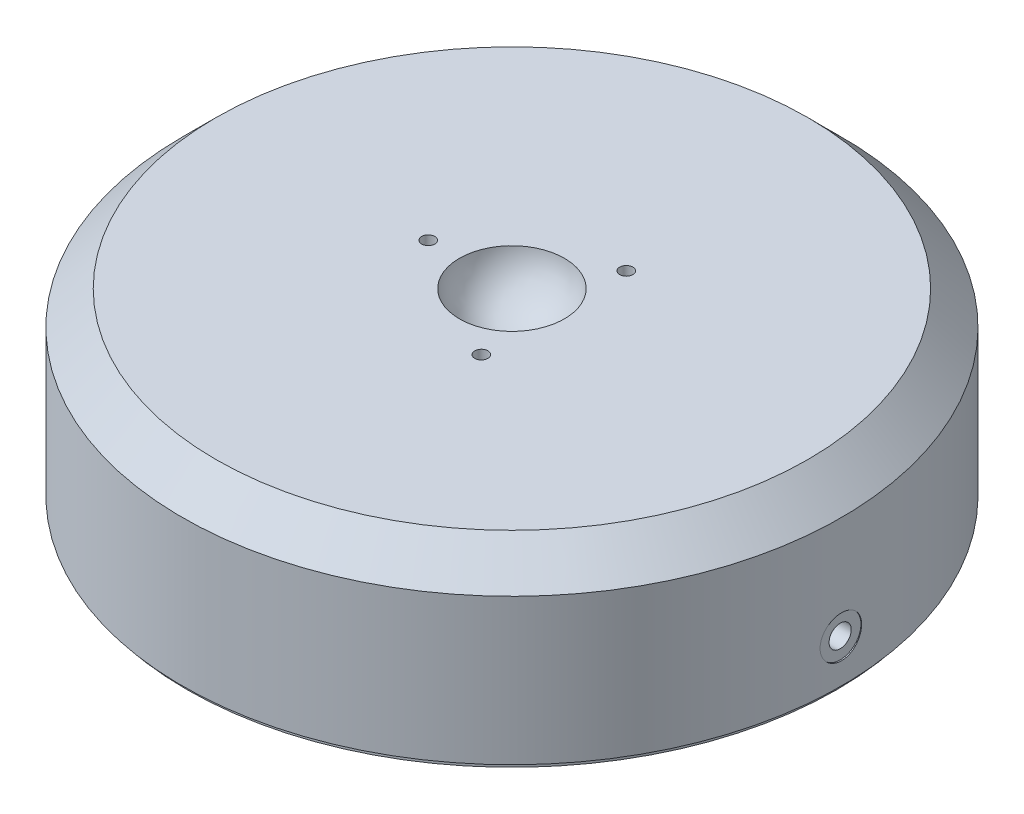
ISO-10303-21;
HEADER;
FILE_DESCRIPTION(('STEP AP214'),'2;1');
FILE_NAME('part.step','',(''),(''),'','','');
FILE_SCHEMA(('AUTOMOTIVE_DESIGN { 1 0 10303 214 1 1 1 1 }'));
ENDSEC;
DATA;
#1=APPLICATION_CONTEXT('core data for automotive mechanical design processes');
#2=APPLICATION_PROTOCOL_DEFINITION('international standard','automotive_design',2000,#1);
#3=PRODUCT_CONTEXT('',#1,'mechanical');
#4=PRODUCT('Part','Part','',(#3));
#5=PRODUCT_RELATED_PRODUCT_CATEGORY('part','',(#4));
#6=PRODUCT_DEFINITION_FORMATION('','',#4);
#7=PRODUCT_DEFINITION_CONTEXT('part definition',#1,'design');
#8=PRODUCT_DEFINITION('design','',#6,#7);
#9=PRODUCT_DEFINITION_SHAPE('','',#8);
#10=(LENGTH_UNIT() NAMED_UNIT(*) SI_UNIT(.MILLI.,.METRE.));
#11=(NAMED_UNIT(*) PLANE_ANGLE_UNIT() SI_UNIT($,.RADIAN.));
#12=(NAMED_UNIT(*) SI_UNIT($,.STERADIAN.) SOLID_ANGLE_UNIT());
#13=UNCERTAINTY_MEASURE_WITH_UNIT(LENGTH_MEASURE(1.E-05),#10,'distance_accuracy_value','');
#14=(GEOMETRIC_REPRESENTATION_CONTEXT(3) GLOBAL_UNCERTAINTY_ASSIGNED_CONTEXT((#13)) GLOBAL_UNIT_ASSIGNED_CONTEXT((#10,
#11,#12)) REPRESENTATION_CONTEXT('',''));
#15=CARTESIAN_POINT('',(0.,0.,0.));
#16=DIRECTION('',(0.,0.,1.));
#17=DIRECTION('',(1.,0.,0.));
#18=AXIS2_PLACEMENT_3D('',#15,#16,#17);
#19=CARTESIAN_POINT('',(0.,0.,0.));
#20=DIRECTION('',(0.,1.,0.));
#21=DIRECTION('',(-1.,0.,0.));
#22=AXIS2_PLACEMENT_3D('',#19,#20,#21);
#23=PLANE('',#22);
#24=CARTESIAN_POINT('',(0.,0.,0.));
#25=DIRECTION('',(0.,1.,0.));
#26=DIRECTION('',(-1.,0.,0.));
#27=AXIS2_PLACEMENT_3D('',#24,#25,#26);
#28=CIRCLE('',#27,62.4967);
#29=CARTESIAN_POINT('',(-62.4967,0.,0.));
#30=VERTEX_POINT('',#29);
#31=EDGE_CURVE('E107',#30,#30,#28,.T.);
#32=ORIENTED_EDGE('',*,*,#31,.F.);
#33=EDGE_LOOP('',(#32));
#34=FACE_BOUND('',#33,.T.);
#35=CARTESIAN_POINT('',(0.,0.,0.));
#36=DIRECTION('',(0.,1.,0.));
#37=DIRECTION('',(-1.,0.,0.));
#38=AXIS2_PLACEMENT_3D('',#35,#36,#37);
#39=CIRCLE('',#38,61.6585);
#40=CARTESIAN_POINT('',(-61.6585,0.,0.));
#41=VERTEX_POINT('',#40);
#42=EDGE_CURVE('E11',#41,#41,#39,.F.);
#43=ORIENTED_EDGE('',*,*,#42,.F.);
#44=EDGE_LOOP('',(#43));
#45=FACE_BOUND('',#44,.T.);
#46=ADVANCED_FACE('F36',(#34,#45),#23,.F.);
#47=CARTESIAN_POINT('',(0.,23.9776,0.));
#48=DIRECTION('',(0.,1.,0.));
#49=DIRECTION('',(-1.,0.,0.));
#50=AXIS2_PLACEMENT_3D('',#47,#48,#49);
#51=CYLINDRICAL_SURFACE('',#50,62.4967);
#52=CARTESIAN_POINT('',(62.372570428755,8.0772,-3.937));
#53=CARTESIAN_POINT('',(62.3725720890185,7.85629250819205,-3.93699028096386));
#54=CARTESIAN_POINT('',(62.373756645424,7.63523042415557,-3.91834463505911));
#55=CARTESIAN_POINT('',(62.3783674224861,7.19921058508358,-3.84423125504575));
#56=CARTESIAN_POINT('',(62.3817962508653,6.98426023509272,-3.78872068479168));
#57=CARTESIAN_POINT('',(62.3905056547258,6.56684276609008,-3.64247846283324));
#58=CARTESIAN_POINT('',(62.3957852511349,6.36436911325499,-3.55176543082544));
#59=CARTESIAN_POINT('',(62.4076000641261,5.97757517470127,-3.33772347926589));
#60=CARTESIAN_POINT('',(62.4141349934931,5.79325075107633,-3.21440201796466));
#61=CARTESIAN_POINT('',(62.4277354120478,5.44765365078752,-2.93843774005859));
#62=CARTESIAN_POINT('',(62.4348016030348,5.28641231300762,-2.78575570829224));
#63=CARTESIAN_POINT('',(62.4486618186523,4.99182664468489,-2.45548530935192));
#64=CARTESIAN_POINT('',(62.4554558319102,4.85848347884577,-2.27789590285199));
#65=CARTESIAN_POINT('',(62.468012201994,4.62338340749682,-1.90267557457054));
#66=CARTESIAN_POINT('',(62.4737737129147,4.52165235142673,-1.70502842569229));
#67=CARTESIAN_POINT('',(62.4836085077519,4.35282980074007,-1.29541689605991));
#68=CARTESIAN_POINT('',(62.487681809973,4.28573793054393,-1.0834526705686));
#69=CARTESIAN_POINT('',(62.49367638382,4.18818497861431,-0.651525065695927));
#70=CARTESIAN_POINT('',(62.4956005319607,4.15767493025864,-0.431572786215224));
#71=CARTESIAN_POINT('',(62.4970896768904,4.13400047292234,0.0103389858161218));
#72=CARTESIAN_POINT('',(62.496654700625,4.14083563738937,0.232298455411981));
#73=CARTESIAN_POINT('',(62.4934770102329,4.1916171894393,0.671592310122174));
#74=CARTESIAN_POINT('',(62.4907375716901,4.23551090198289,0.888932811350949));
#75=CARTESIAN_POINT('',(62.4832631387856,4.35908182429764,1.31315483091667));
#76=CARTESIAN_POINT('',(62.4785281324773,4.43875924829095,1.52003628663143));
#77=CARTESIAN_POINT('',(62.4675900480543,4.63169546939245,1.91763665629313));
#78=CARTESIAN_POINT('',(62.4613859272532,4.74497813191741,2.10834395966332));
#79=CARTESIAN_POINT('',(62.4482078169555,5.00189178554977,2.46805574331988));
#80=CARTESIAN_POINT('',(62.4412338186534,5.14552312378974,2.63705997532779));
#81=CARTESIAN_POINT('',(62.4272865012383,5.45935444740958,2.94887566314058));
#82=CARTESIAN_POINT('',(62.4203132043516,5.6296001541432,3.09164110706965));
#83=CARTESIAN_POINT('',(62.4071655711437,5.99166739260435,3.34657185626651));
#84=CARTESIAN_POINT('',(62.4009912351459,6.1834889330644,3.45873714914927));
#85=CARTESIAN_POINT('',(62.3901387793076,6.58329203302694,3.64928038608318));
#86=CARTESIAN_POINT('',(62.3854607457017,6.79127452305716,3.72765638288402));
#87=CARTESIAN_POINT('',(62.3781315105066,7.21748220730516,3.84836440374867));
#88=CARTESIAN_POINT('',(62.3754802846928,7.43570727906942,3.89069685860943));
#89=CARTESIAN_POINT('',(62.3725081902671,7.87580413283266,3.93805878781967));
#90=CARTESIAN_POINT('',(62.3721833258386,8.09766900552034,3.94315222515225));
#91=CARTESIAN_POINT('',(62.3738901507959,8.53910035206581,3.91605866417158));
#92=CARTESIAN_POINT('',(62.3759218277217,8.75866683806987,3.88387186297355));
#93=CARTESIAN_POINT('',(62.3821091297166,9.18908778425891,3.78318462756799));
#94=CARTESIAN_POINT('',(62.3862630312323,9.39994916428616,3.71471365967655));
#95=CARTESIAN_POINT('',(62.3962252084388,9.80718791277105,3.54343158124978));
#96=CARTESIAN_POINT('',(62.4020334993717,10.0035651477642,3.4406201543318));
#97=CARTESIAN_POINT('',(62.4146596060516,10.3765549593453,3.20341218055619));
#98=CARTESIAN_POINT('',(62.4214787868046,10.553140235677,3.06897278003505));
#99=CARTESIAN_POINT('',(62.4353534416259,10.8812584879436,2.77238746211599));
#100=CARTESIAN_POINT('',(62.442408918043,11.032791214756,2.61024126923443));
#101=CARTESIAN_POINT('',(62.4559728000091,11.30671900463,2.26256979509692));
#102=CARTESIAN_POINT('',(62.4624804199821,11.4290726729886,2.07701186445178));
#103=CARTESIAN_POINT('',(62.4742040159706,11.6408858924198,1.68794839143629));
#104=CARTESIAN_POINT('',(62.4794200000555,11.7303456489985,1.48444296120355));
#105=CARTESIAN_POINT('',(62.4879688513937,11.8737596296695,1.06541336581375));
#106=CARTESIAN_POINT('',(62.4913031072478,11.9277400402159,0.849898192498591));
#107=CARTESIAN_POINT('',(62.4957183439937,11.998748719611,0.412841808212963));
#108=CARTESIAN_POINT('',(62.4967993474728,12.0157773588748,0.19130065767116));
#109=CARTESIAN_POINT('',(62.4965863440578,12.0123955028836,-0.251109233314158));
#110=CARTESIAN_POINT('',(62.4952964464352,11.9920497853074,-0.47197847382767));
#111=CARTESIAN_POINT('',(62.4904948505731,11.9146310775853,-0.907158003403282));
#112=CARTESIAN_POINT('',(62.4869831484417,11.8575580231069,-1.12146828097584));
#113=CARTESIAN_POINT('',(62.4781326434797,11.7083193821693,-1.53745606376745));
#114=CARTESIAN_POINT('',(62.4727938550518,11.6161540723376,-1.73913366855358));
#115=CARTESIAN_POINT('',(62.4608885568106,11.3993561443507,-2.12416059858145));
#116=CARTESIAN_POINT('',(62.4543220785873,11.2747243615664,-2.30751039523456));
#117=CARTESIAN_POINT('',(62.440686478893,10.9962919324557,-2.65100563744978));
#118=CARTESIAN_POINT('',(62.433616561856,10.8424444482703,-2.81111308409266));
#119=CARTESIAN_POINT('',(62.4197772500197,10.5100108368205,-3.10328437062465));
#120=CARTESIAN_POINT('',(62.4130079291752,10.3314186657346,-3.23534133924044));
#121=CARTESIAN_POINT('',(62.4005267642416,9.95435823532383,-3.46776249632599));
#122=CARTESIAN_POINT('',(62.3948162566916,9.75586533550635,-3.56808673979917));
#123=CARTESIAN_POINT('',(62.3851164023794,9.3449607681873,-3.73386158971641));
#124=CARTESIAN_POINT('',(62.3811250415325,9.13256572595419,-3.79935302616075));
#125=CARTESIAN_POINT('',(62.3763610444554,8.77859348472015,-3.87658833170758));
#126=CARTESIAN_POINT('',(62.3749459193762,8.63930414883599,-3.89921339547466));
#127=CARTESIAN_POINT('',(62.3730500824086,8.35909752799471,-3.9294223202492));
#128=CARTESIAN_POINT('',(62.3725693691967,8.21818024534366,-3.93700620256057));
#129=CARTESIAN_POINT('',(62.372570428755,8.0772,-3.937));
#130=B_SPLINE_CURVE_WITH_KNOTS('',3,(#52,#53,#54,#55,#56,#57,#58,#59,#60,#61,#62,#63,#64,#65,
#66,#67,#68,#69,#70,#71,#72,#73,#74,#75,#76,#77,#78,#79,#80,#81,#82,#83,#84,#85,#86,#87,#88,#89,
#90,#91,#92,#93,#94,#95,#96,#97,#98,#99,#100,#101,#102,#103,#104,#105,#106,#107,#108,#109,#110,
#111,#112,#113,#114,#115,#116,#117,#118,#119,#120,#121,#122,#123,#124,#125,#126,#127,#128,#129),
.UNSPECIFIED.,.T.,.F.,(4,2,2,2,2,2,2,2,2,2,2,2,2,2,2,2,2,2,2,2,2,2,2,2,2,2,2,2,2,2,2,2,2,2,2,2,
2,2,4),(0.,0.662207807942045,1.32518643473369,1.98781486805592,2.65029187487592,
3.31365993681306,3.97705568777383,4.64099248314746,5.30492207955468,5.96796197686456,
6.63099430103149,7.29308577428267,7.95518121125223,8.61774797849119,9.28032232467586,
9.94404768890895,10.6077733217764,11.271537199514,11.935293143751,12.5979087301274,
13.2605208130116,13.9225956124307,14.5846765117903,15.2476597035839,15.9106494876833,
16.5745742967136,17.2384949577749,17.9019250430013,18.5653484777832,19.227623143937,
19.889898970152,20.5521695758428,21.2144231428203,21.8777475204073,22.5412341996902,
23.2055527791527,23.8690909379666,24.2917038185814,24.714316100619),.UNSPECIFIED.);
#131=CARTESIAN_POINT('',(62.372570428755,8.0772,-3.937));
#132=VERTEX_POINT('',#131);
#133=EDGE_CURVE('E43',#132,#132,#130,.T.);
#134=ORIENTED_EDGE('',*,*,#133,.T.);
#135=EDGE_LOOP('',(#134));
#136=FACE_BOUND('',#135,.T.);
#137=CARTESIAN_POINT('',(0.,27.6606,0.));
#138=DIRECTION('',(0.,1.,0.));
#139=DIRECTION('',(-1.,0.,0.));
#140=AXIS2_PLACEMENT_3D('',#137,#138,#139);
#141=CIRCLE('',#140,62.4967);
#142=CARTESIAN_POINT('',(-62.4967,27.6606,0.));
#143=VERTEX_POINT('',#142);
#144=EDGE_CURVE('E104',#143,#143,#141,.T.);
#145=ORIENTED_EDGE('',*,*,#144,.F.);
#146=EDGE_LOOP('',(#145));
#147=FACE_BOUND('',#146,.T.);
#148=ORIENTED_EDGE('',*,*,#31,.T.);
#149=EDGE_LOOP('',(#148));
#150=FACE_BOUND('',#149,.T.);
#151=ADVANCED_FACE('F113',(#136,#147,#150),#51,.T.);
#152=CARTESIAN_POINT('',(0.,27.6606,0.));
#153=DIRECTION('',(0.,-1.,0.));
#154=DIRECTION('',(1.,0.,0.));
#155=AXIS2_PLACEMENT_3D('',#152,#153,#154);
#156=CONICAL_SURFACE('',#155,62.4967,0.785398163397449);
#157=CARTESIAN_POINT('',(0.,34.0106,0.));
#158=DIRECTION('',(0.,1.,0.));
#159=DIRECTION('',(-1.,0.,0.));
#160=AXIS2_PLACEMENT_3D('',#157,#158,#159);
#161=CIRCLE('',#160,56.1467);
#162=CARTESIAN_POINT('',(-56.1467,34.0106,0.));
#163=VERTEX_POINT('',#162);
#164=EDGE_CURVE('E101',#163,#163,#161,.T.);
#165=ORIENTED_EDGE('',*,*,#164,.F.);
#166=EDGE_LOOP('',(#165));
#167=FACE_BOUND('',#166,.T.);
#168=ORIENTED_EDGE('',*,*,#144,.T.);
#169=EDGE_LOOP('',(#168));
#170=FACE_BOUND('',#169,.T.);
#171=ADVANCED_FACE('F162',(#167,#170),#156,.T.);
#172=CARTESIAN_POINT('',(56.1467,34.0106,0.));
#173=DIRECTION('',(0.,-1.,0.));
#174=DIRECTION('',(1.,0.,0.));
#175=AXIS2_PLACEMENT_3D('',#172,#173,#174);
#176=PLANE('',#175);
#177=CARTESIAN_POINT('',(7.93749999999987,34.0106,13.748153285078));
#178=DIRECTION('',(0.,1.,0.));
#179=DIRECTION('',(0.,0.,1.));
#180=AXIS2_PLACEMENT_3D('',#177,#178,#179);
#181=CIRCLE('',#180,1.24999999999999);
#182=CARTESIAN_POINT('',(7.93749999999987,34.0106,14.998153285078));
#183=VERTEX_POINT('',#182);
#184=EDGE_CURVE('E66',#183,#183,#181,.T.);
#185=ORIENTED_EDGE('',*,*,#184,.F.);
#186=EDGE_LOOP('',(#185));
#187=FACE_BOUND('',#186,.T.);
#188=CARTESIAN_POINT('',(7.93750000000007,34.0106,-13.7481532850779));
#189=DIRECTION('',(0.,1.,0.));
#190=DIRECTION('',(0.,0.,1.));
#191=AXIS2_PLACEMENT_3D('',#188,#189,#190);
#192=CIRCLE('',#191,1.24999999999999);
#193=CARTESIAN_POINT('',(7.93750000000007,34.0106,-12.4981532850779));
#194=VERTEX_POINT('',#193);
#195=EDGE_CURVE('E80',#194,#194,#192,.T.);
#196=ORIENTED_EDGE('',*,*,#195,.F.);
#197=EDGE_LOOP('',(#196));
#198=FACE_BOUND('',#197,.T.);
#199=CARTESIAN_POINT('',(-15.875,34.0106,0.));
#200=DIRECTION('',(0.,1.,0.));
#201=DIRECTION('',(0.,0.,1.));
#202=AXIS2_PLACEMENT_3D('',#199,#200,#201);
#203=CIRCLE('',#202,1.24999999999999);
#204=CARTESIAN_POINT('',(-15.875,34.0106,1.24999999999999));
#205=VERTEX_POINT('',#204);
#206=EDGE_CURVE('E86',#205,#205,#203,.T.);
#207=ORIENTED_EDGE('',*,*,#206,.F.);
#208=EDGE_LOOP('',(#207));
#209=FACE_BOUND('',#208,.T.);
#210=CARTESIAN_POINT('',(0.,34.0106,0.));
#211=DIRECTION('',(0.,1.,0.));
#212=DIRECTION('',(-1.,0.,0.));
#213=AXIS2_PLACEMENT_3D('',#210,#211,#212);
#214=CIRCLE('',#213,9.95589281581517);
#215=CARTESIAN_POINT('',(-9.95589281581517,34.0106,0.));
#216=VERTEX_POINT('',#215);
#217=EDGE_CURVE('E98',#216,#216,#214,.T.);
#218=ORIENTED_EDGE('',*,*,#217,.F.);
#219=EDGE_LOOP('',(#218));
#220=FACE_BOUND('',#219,.T.);
#221=ORIENTED_EDGE('',*,*,#164,.T.);
#222=EDGE_LOOP('',(#221));
#223=FACE_BOUND('',#222,.T.);
#224=ADVANCED_FACE('F159',(#187,#198,#209,#220,#223),#176,.F.);
#225=CARTESIAN_POINT('',(0.,35.0266,0.));
#226=DIRECTION('',(0.,1.,0.));
#227=DIRECTION('',(1.,0.,0.));
#228=AXIS2_PLACEMENT_3D('',#225,#226,#227);
#229=SPHERICAL_SURFACE('',#228,10.0076);
#230=CARTESIAN_POINT('',(0.,25.3079877533878,0.));
#231=DIRECTION('',(0.,1.,0.));
#232=DIRECTION('',(-1.,0.,0.));
#233=AXIS2_PLACEMENT_3D('',#230,#231,#232);
#234=CIRCLE('',#233,2.3876);
#235=CARTESIAN_POINT('',(-2.3876,25.3079877533878,0.));
#236=VERTEX_POINT('',#235);
#237=EDGE_CURVE('E95',#236,#236,#234,.T.);
#238=ORIENTED_EDGE('',*,*,#237,.F.);
#239=EDGE_LOOP('',(#238));
#240=FACE_BOUND('',#239,.T.);
#241=ORIENTED_EDGE('',*,*,#217,.T.);
#242=EDGE_LOOP('',(#241));
#243=FACE_BOUND('',#242,.T.);
#244=ADVANCED_FACE('F155',(#240,#243),#229,.F.);
#245=CARTESIAN_POINT('',(0.,23.9776,0.));
#246=DIRECTION('',(0.,1.,0.));
#247=DIRECTION('',(-1.,0.,0.));
#248=AXIS2_PLACEMENT_3D('',#245,#246,#247);
#249=CYLINDRICAL_SURFACE('',#248,2.3876);
#250=CARTESIAN_POINT('',(0.,24.6126,0.));
#251=DIRECTION('',(0.,1.,0.));
#252=DIRECTION('',(-1.,0.,0.));
#253=AXIS2_PLACEMENT_3D('',#250,#251,#252);
#254=CIRCLE('',#253,2.3876);
#255=CARTESIAN_POINT('',(-2.3876,24.6126,0.));
#256=VERTEX_POINT('',#255);
#257=EDGE_CURVE('E92',#256,#256,#254,.T.);
#258=ORIENTED_EDGE('',*,*,#257,.F.);
#259=EDGE_LOOP('',(#258));
#260=FACE_BOUND('',#259,.T.);
#261=ORIENTED_EDGE('',*,*,#237,.T.);
#262=EDGE_LOOP('',(#261));
#263=FACE_BOUND('',#262,.T.);
#264=ADVANCED_FACE('F151',(#260,#263),#249,.F.);
#265=CARTESIAN_POINT('',(0.,24.6126,0.));
#266=DIRECTION('',(0.,-1.,0.));
#267=DIRECTION('',(1.,0.,0.));
#268=AXIS2_PLACEMENT_3D('',#265,#266,#267);
#269=PLANE('',#268);
#270=ORIENTED_EDGE('',*,*,#257,.T.);
#271=EDGE_LOOP('',(#270));
#272=FACE_BOUND('',#271,.T.);
#273=ADVANCED_FACE('F139',(#272),#269,.F.);
#274=CARTESIAN_POINT('',(-15.875,34.0106,0.));
#275=DIRECTION('',(0.,1.,0.));
#276=DIRECTION('',(0.,0.,1.));
#277=AXIS2_PLACEMENT_3D('',#274,#275,#276);
#278=CYLINDRICAL_SURFACE('',#277,1.24999999999999);
#279=CARTESIAN_POINT('',(-15.875,24.3586,0.));
#280=DIRECTION('',(0.,1.,0.));
#281=DIRECTION('',(0.,0.,1.));
#282=AXIS2_PLACEMENT_3D('',#279,#280,#281);
#283=CIRCLE('',#282,1.24999999999999);
#284=CARTESIAN_POINT('',(-15.875,24.3586,1.24999999999999));
#285=VERTEX_POINT('',#284);
#286=EDGE_CURVE('E83',#285,#285,#283,.T.);
#287=ORIENTED_EDGE('',*,*,#286,.F.);
#288=EDGE_LOOP('',(#287));
#289=FACE_BOUND('',#288,.T.);
#290=ORIENTED_EDGE('',*,*,#206,.T.);
#291=EDGE_LOOP('',(#290));
#292=FACE_BOUND('',#291,.T.);
#293=ADVANCED_FACE('F136',(#289,#292),#278,.F.);
#294=CARTESIAN_POINT('',(-15.875,24.3586,0.));
#295=DIRECTION('',(0.,1.,0.));
#296=DIRECTION('',(0.,0.,1.));
#297=AXIS2_PLACEMENT_3D('',#294,#295,#296);
#298=CONICAL_SURFACE('',#297,1.24999999999999,1.02974425867665);
#299=CARTESIAN_POINT('',(-15.875,23.6075242262156,0.));
#300=VERTEX_POINT('',#299);
#301=VERTEX_LOOP('',#300);
#302=FACE_BOUND('',#301,.T.);
#303=ORIENTED_EDGE('',*,*,#286,.T.);
#304=EDGE_LOOP('',(#303));
#305=FACE_BOUND('',#304,.T.);
#306=ADVANCED_FACE('F132',(#302,#305),#298,.F.);
#307=CARTESIAN_POINT('',(7.93750000000007,34.0106,-13.7481532850779));
#308=DIRECTION('',(0.,1.,0.));
#309=DIRECTION('',(0.,0.,1.));
#310=AXIS2_PLACEMENT_3D('',#307,#308,#309);
#311=CYLINDRICAL_SURFACE('',#310,1.24999999999999);
#312=CARTESIAN_POINT('',(7.93750000000007,24.3586,-13.7481532850779));
#313=DIRECTION('',(0.,1.,0.));
#314=DIRECTION('',(0.,0.,1.));
#315=AXIS2_PLACEMENT_3D('',#312,#313,#314);
#316=CIRCLE('',#315,1.24999999999999);
#317=CARTESIAN_POINT('',(7.93750000000007,24.3586,-12.4981532850779));
#318=VERTEX_POINT('',#317);
#319=EDGE_CURVE('E70',#318,#318,#316,.T.);
#320=ORIENTED_EDGE('',*,*,#319,.F.);
#321=EDGE_LOOP('',(#320));
#322=FACE_BOUND('',#321,.T.);
#323=ORIENTED_EDGE('',*,*,#195,.T.);
#324=EDGE_LOOP('',(#323));
#325=FACE_BOUND('',#324,.T.);
#326=ADVANCED_FACE('F128',(#322,#325),#311,.F.);
#327=CARTESIAN_POINT('',(7.93750000000007,24.3586,-13.7481532850779));
#328=DIRECTION('',(0.,1.,0.));
#329=DIRECTION('',(0.,0.,1.));
#330=AXIS2_PLACEMENT_3D('',#327,#328,#329);
#331=CONICAL_SURFACE('',#330,1.24999999999999,1.02974425867665);
#332=CARTESIAN_POINT('',(7.93750000000006,23.6075242262156,-13.7481532850779));
#333=VERTEX_POINT('',#332);
#334=VERTEX_LOOP('',#333);
#335=FACE_BOUND('',#334,.T.);
#336=ORIENTED_EDGE('',*,*,#319,.T.);
#337=EDGE_LOOP('',(#336));
#338=FACE_BOUND('',#337,.T.);
#339=ADVANCED_FACE('F125',(#335,#338),#331,.F.);
#340=CARTESIAN_POINT('',(7.93749999999987,34.0106,13.748153285078));
#341=DIRECTION('',(0.,1.,0.));
#342=DIRECTION('',(0.,0.,1.));
#343=AXIS2_PLACEMENT_3D('',#340,#341,#342);
#344=CYLINDRICAL_SURFACE('',#343,1.24999999999999);
#345=CARTESIAN_POINT('',(7.93749999999987,24.3586,13.748153285078));
#346=DIRECTION('',(0.,1.,0.));
#347=DIRECTION('',(0.,0.,1.));
#348=AXIS2_PLACEMENT_3D('',#345,#346,#347);
#349=CIRCLE('',#348,1.24999999999999);
#350=CARTESIAN_POINT('',(7.93749999999987,24.3586,14.998153285078));
#351=VERTEX_POINT('',#350);
#352=EDGE_CURVE('E64',#351,#351,#349,.T.);
#353=ORIENTED_EDGE('',*,*,#352,.F.);
#354=EDGE_LOOP('',(#353));
#355=FACE_BOUND('',#354,.T.);
#356=ORIENTED_EDGE('',*,*,#184,.T.);
#357=EDGE_LOOP('',(#356));
#358=FACE_BOUND('',#357,.T.);
#359=ADVANCED_FACE('F60',(#355,#358),#344,.F.);
#360=CARTESIAN_POINT('',(7.93749999999987,24.3586,13.748153285078));
#361=DIRECTION('',(0.,1.,0.));
#362=DIRECTION('',(0.,0.,1.));
#363=AXIS2_PLACEMENT_3D('',#360,#361,#362);
#364=CONICAL_SURFACE('',#363,1.24999999999999,1.02974425867665);
#365=CARTESIAN_POINT('',(7.93749999999987,23.6075242262156,13.748153285078));
#366=VERTEX_POINT('',#365);
#367=VERTEX_LOOP('',#366);
#368=FACE_BOUND('',#367,.T.);
#369=ORIENTED_EDGE('',*,*,#352,.T.);
#370=EDGE_LOOP('',(#369));
#371=FACE_BOUND('',#370,.T.);
#372=ADVANCED_FACE('F56',(#368,#371),#364,.F.);
#373=CARTESIAN_POINT('',(62.4967,8.0772,0.));
#374=DIRECTION('',(1.,0.,0.));
#375=DIRECTION('',(0.,0.,-1.));
#376=AXIS2_PLACEMENT_3D('',#373,#374,#375);
#377=CYLINDRICAL_SURFACE('',#376,3.937);
#378=CARTESIAN_POINT('',(62.2427,8.0772,0.));
#379=DIRECTION('',(1.,0.,0.));
#380=DIRECTION('',(0.,0.,-1.));
#381=AXIS2_PLACEMENT_3D('',#378,#379,#380);
#382=CIRCLE('',#381,3.937);
#383=CARTESIAN_POINT('',(62.2427,8.0772,-3.937));
#384=VERTEX_POINT('',#383);
#385=EDGE_CURVE('E73',#384,#384,#382,.T.);
#386=ORIENTED_EDGE('',*,*,#385,.F.);
#387=EDGE_LOOP('',(#386));
#388=FACE_BOUND('',#387,.T.);
#389=ORIENTED_EDGE('',*,*,#133,.F.);
#390=EDGE_LOOP('',(#389));
#391=FACE_BOUND('',#390,.T.);
#392=ADVANCED_FACE('F59',(#388,#391),#377,.F.);
#393=CARTESIAN_POINT('',(62.2427,8.7757,0.));
#394=DIRECTION('',(-1.,0.,0.));
#395=DIRECTION('',(0.,0.,1.));
#396=AXIS2_PLACEMENT_3D('',#393,#394,#395);
#397=PLANE('',#396);
#398=ORIENTED_EDGE('',*,*,#385,.T.);
#399=EDGE_LOOP('',(#398));
#400=FACE_BOUND('',#399,.T.);
#401=CARTESIAN_POINT('',(62.2427,8.0772,0.));
#402=DIRECTION('',(-1.,0.,0.));
#403=DIRECTION('',(0.,0.,1.));
#404=AXIS2_PLACEMENT_3D('',#401,#402,#403);
#405=CIRCLE('',#404,2.09999999999999);
#406=CARTESIAN_POINT('',(62.2427,8.0772,2.09999999999999));
#407=VERTEX_POINT('',#406);
#408=EDGE_CURVE('E67',#407,#407,#405,.F.);
#409=ORIENTED_EDGE('',*,*,#408,.F.);
#410=EDGE_LOOP('',(#409));
#411=FACE_BOUND('',#410,.T.);
#412=ADVANCED_FACE('F119',(#400,#411),#397,.F.);
#413=CARTESIAN_POINT('',(15.5067,8.0772,0.));
#414=DIRECTION('',(1.,0.,0.));
#415=DIRECTION('',(0.,0.,-1.));
#416=AXIS2_PLACEMENT_3D('',#413,#414,#415);
#417=CONICAL_SURFACE('',#416,2.09999999999999,1.02974425867665);
#418=CARTESIAN_POINT('',(14.2448927000421,8.07719999999999,0.));
#419=VERTEX_POINT('',#418);
#420=VERTEX_LOOP('',#419);
#421=FACE_BOUND('',#420,.T.);
#422=CARTESIAN_POINT('',(15.5067,8.0772,0.));
#423=DIRECTION('',(1.,0.,0.));
#424=DIRECTION('',(0.,0.,-1.));
#425=AXIS2_PLACEMENT_3D('',#422,#423,#424);
#426=CIRCLE('',#425,2.09999999999999);
#427=CARTESIAN_POINT('',(15.5067,8.0772,-2.1));
#428=VERTEX_POINT('',#427);
#429=EDGE_CURVE('E89',#428,#428,#426,.T.);
#430=ORIENTED_EDGE('',*,*,#429,.T.);
#431=EDGE_LOOP('',(#430));
#432=FACE_BOUND('',#431,.T.);
#433=ADVANCED_FACE('F141',(#421,#432),#417,.F.);
#434=CARTESIAN_POINT('',(62.4967,8.0772,0.));
#435=DIRECTION('',(1.,0.,0.));
#436=DIRECTION('',(0.,0.,-1.));
#437=AXIS2_PLACEMENT_3D('',#434,#435,#436);
#438=CYLINDRICAL_SURFACE('',#437,2.09999999999999);
#439=ORIENTED_EDGE('',*,*,#408,.T.);
#440=EDGE_LOOP('',(#439));
#441=FACE_BOUND('',#440,.T.);
#442=ORIENTED_EDGE('',*,*,#429,.F.);
#443=EDGE_LOOP('',(#442));
#444=FACE_BOUND('',#443,.T.);
#445=ADVANCED_FACE('F144',(#441,#444),#438,.F.);
#446=CARTESIAN_POINT('',(0.,-1.016,0.));
#447=DIRECTION('',(0.,1.,0.));
#448=DIRECTION('',(-1.,0.,0.));
#449=AXIS2_PLACEMENT_3D('',#446,#447,#448);
#450=CYLINDRICAL_SURFACE('',#449,61.6585);
#451=CARTESIAN_POINT('',(0.,-1.016,0.));
#452=DIRECTION('',(0.,-1.,0.));
#453=DIRECTION('',(1.,0.,0.));
#454=AXIS2_PLACEMENT_3D('',#451,#452,#453);
#455=CIRCLE('',#454,61.6585);
#456=CARTESIAN_POINT('',(61.6585,-1.016,0.));
#457=VERTEX_POINT('',#456);
#458=EDGE_CURVE('E190',#457,#457,#455,.T.);
#459=ORIENTED_EDGE('',*,*,#458,.F.);
#460=EDGE_LOOP('',(#459));
#461=FACE_BOUND('',#460,.T.);
#462=ORIENTED_EDGE('',*,*,#42,.T.);
#463=EDGE_LOOP('',(#462));
#464=FACE_BOUND('',#463,.T.);
#465=ADVANCED_FACE('F147',(#461,#464),#450,.T.);
#466=CARTESIAN_POINT('',(0.,-1.016,0.));
#467=DIRECTION('',(0.,-1.,0.));
#468=DIRECTION('',(1.,0.,0.));
#469=AXIS2_PLACEMENT_3D('',#466,#467,#468);
#470=PLANE('',#469);
#471=ORIENTED_EDGE('',*,*,#458,.T.);
#472=EDGE_LOOP('',(#471));
#473=FACE_BOUND('',#472,.T.);
#474=ADVANCED_FACE('F181',(#473),#470,.T.);
#475=CLOSED_SHELL('',(#46,#151,#171,#224,#244,#264,#273,#293,#306,#326,#339,#359,#372,#392,#412,
#433,#445,#465,#474));
#476=MANIFOLD_SOLID_BREP('B2',#475);
#477=ADVANCED_BREP_SHAPE_REPRESENTATION('',(#18,#476),#14);
#478=SHAPE_DEFINITION_REPRESENTATION(#9,#477);
ENDSEC;
END-ISO-10303-21;
